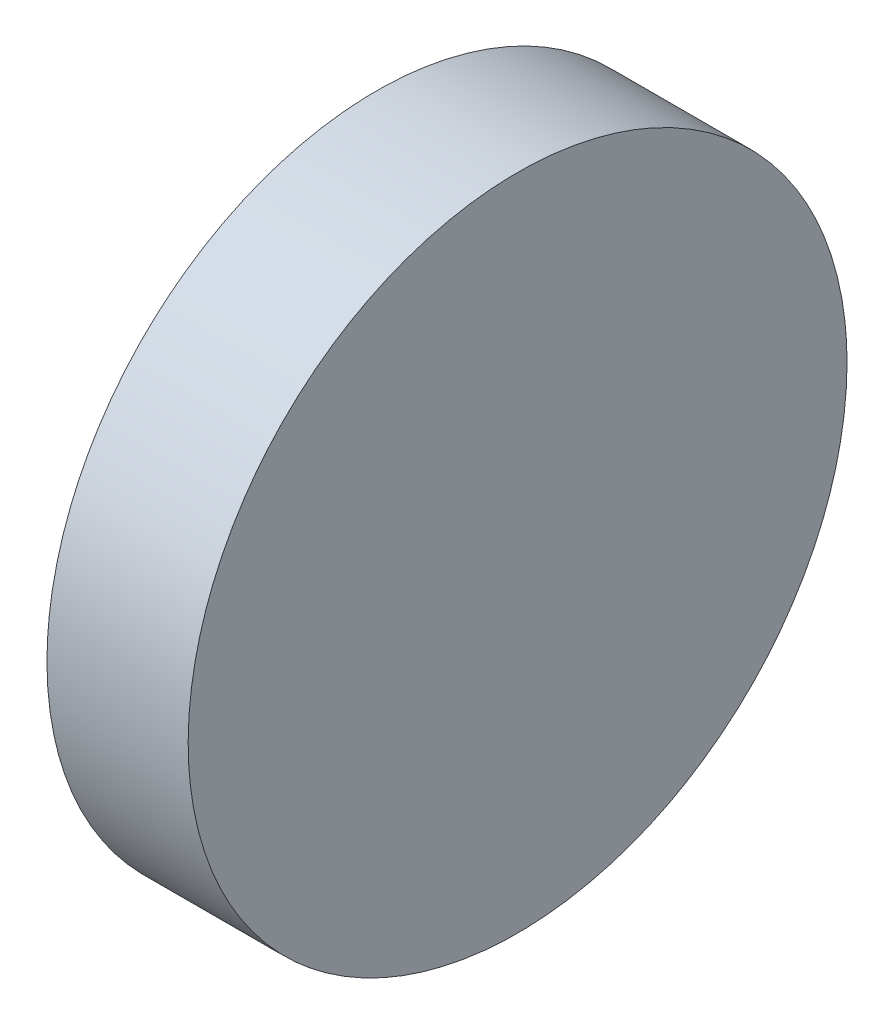
ISO-10303-21;
HEADER;
FILE_DESCRIPTION(('STEP AP214'),'2;1');
FILE_NAME('part.step','',(''),(''),'','','');
FILE_SCHEMA(('AUTOMOTIVE_DESIGN { 1 0 10303 214 1 1 1 1 }'));
ENDSEC;
DATA;
#1=APPLICATION_CONTEXT('core data for automotive mechanical design processes');
#2=APPLICATION_PROTOCOL_DEFINITION('international standard','automotive_design',2000,#1);
#3=PRODUCT_CONTEXT('',#1,'mechanical');
#4=PRODUCT('Part','Part','',(#3));
#5=PRODUCT_RELATED_PRODUCT_CATEGORY('part','',(#4));
#6=PRODUCT_DEFINITION_FORMATION('','',#4);
#7=PRODUCT_DEFINITION_CONTEXT('part definition',#1,'design');
#8=PRODUCT_DEFINITION('design','',#6,#7);
#9=PRODUCT_DEFINITION_SHAPE('','',#8);
#10=(LENGTH_UNIT() NAMED_UNIT(*) SI_UNIT(.MILLI.,.METRE.));
#11=(NAMED_UNIT(*) PLANE_ANGLE_UNIT() SI_UNIT($,.RADIAN.));
#12=(NAMED_UNIT(*) SI_UNIT($,.STERADIAN.) SOLID_ANGLE_UNIT());
#13=UNCERTAINTY_MEASURE_WITH_UNIT(LENGTH_MEASURE(1.E-05),#10,'distance_accuracy_value','');
#14=(GEOMETRIC_REPRESENTATION_CONTEXT(3) GLOBAL_UNCERTAINTY_ASSIGNED_CONTEXT((#13)) GLOBAL_UNIT_ASSIGNED_CONTEXT((#10,
#11,#12)) REPRESENTATION_CONTEXT('',''));
#15=CARTESIAN_POINT('',(0.,0.,0.));
#16=DIRECTION('',(0.,0.,1.));
#17=DIRECTION('',(1.,0.,0.));
#18=AXIS2_PLACEMENT_3D('',#15,#16,#17);
#19=CARTESIAN_POINT('',(24.3378726721836,72.9827002839282,19.0680504904314));
#20=CARTESIAN_POINT('',(24.3378726721836,73.1845762589774,19.0680504904314));
#21=CARTESIAN_POINT('',(24.3378726721836,73.5883282090757,19.1483617466597));
#22=CARTESIAN_POINT('',(24.3378726721836,74.1017547726504,19.4914224085805));
#23=CARTESIAN_POINT('',(24.3378726721836,74.4448154345712,20.0048489721551));
#24=CARTESIAN_POINT('',(24.3378726721836,74.5652823189135,20.6104768973026));
#25=CARTESIAN_POINT('',(24.3378726721836,74.4448154345712,21.2161048224502));
#26=CARTESIAN_POINT('',(24.3378726721836,74.1017547726503,21.7295313860247));
#27=CARTESIAN_POINT('',(24.3378726721836,73.5883282090757,22.0725920479456));
#28=CARTESIAN_POINT('',(24.3378726721836,72.9827002839282,22.1930589322879));
#29=CARTESIAN_POINT('',(24.3378726721836,72.3770723587807,22.0725920479456));
#30=CARTESIAN_POINT('',(24.3378726721836,71.8636457952061,21.7295313860248));
#31=CARTESIAN_POINT('',(24.3378726721836,71.5205851332853,21.2161048224502));
#32=CARTESIAN_POINT('',(24.3378726721836,71.4001182489429,20.6104768973026));
#33=CARTESIAN_POINT('',(24.3378726721836,71.5205851332853,20.0048489721551));
#34=CARTESIAN_POINT('',(24.3378726721836,71.8636457952061,19.4914224085805));
#35=CARTESIAN_POINT('',(24.3378726721836,72.3770723587808,19.1483617466597));
#36=CARTESIAN_POINT('',(24.3378726721836,72.7808243088791,19.0680504904314));
#37=CARTESIAN_POINT('',(24.3378726721836,72.9827002839282,19.0680504904314));
#38=B_SPLINE_CURVE_WITH_KNOTS('',3,(#19,#20,#21,#22,#23,#24,#25,#26,#27,#28,#29,#30,#31,#32,#33,
#34,#35,#36,#37),.UNSPECIFIED.,.T.,.F.,(4,1,1,1,1,1,1,1,1,1,1,1,1,1,1,1,4),(0.,0.0625,0.125,
0.1875,0.25,0.3125,0.375,0.4375,0.5,0.5625,0.625,0.6875,0.75,0.8125,0.875,0.9375,1.),.UNSPECIFIED.);
#39=DIRECTION('',(1.,0.,0.));
#40=VECTOR('',#39,1.);
#41=SURFACE_OF_LINEAR_EXTRUSION('',#38,#40);
#42=CARTESIAN_POINT('',(24.3378726721836,72.9827002839282,19.0680504904314));
#43=CARTESIAN_POINT('',(24.3378726721836,73.0064508886733,19.068050473735));
#44=CARTESIAN_POINT('',(24.3378726721836,73.0302010762025,19.0686062989326));
#45=CARTESIAN_POINT('',(24.3378726721836,73.077651410537,19.0708195103253));
#46=CARTESIAN_POINT('',(24.3378726721836,73.1013515545836,19.0724769557398));
#47=CARTESIAN_POINT('',(24.3378726721836,73.1486515866271,19.0768834275041));
#48=CARTESIAN_POINT('',(24.3378726721836,73.1722514679272,19.0796325256457));
#49=CARTESIAN_POINT('',(24.3378726721836,73.2193010510757,19.0862123470967));
#50=CARTESIAN_POINT('',(24.3378726721836,73.2427507458694,19.0900431208397));
#51=CARTESIAN_POINT('',(24.3378726721836,73.2894499432848,19.0987763891936));
#52=CARTESIAN_POINT('',(24.3378726721836,73.3126994438637,19.1036788947262));
#53=CARTESIAN_POINT('',(24.3378726721836,73.35894827338,19.1145456935742));
#54=CARTESIAN_POINT('',(24.3378726721836,73.3819476097291,19.1205099553413));
#55=CARTESIAN_POINT('',(24.3378726721836,73.4276460489969,19.1334905049019));
#56=CARTESIAN_POINT('',(24.3378726721836,73.4503451696174,19.1405067303642));
#57=CARTESIAN_POINT('',(24.3378726721836,73.495393382694,19.1555808064373));
#58=CARTESIAN_POINT('',(24.3378726721836,73.5177424976411,19.1636385898081));
#59=CARTESIAN_POINT('',(24.3378726721836,73.5620399154895,19.1807876959835));
#60=CARTESIAN_POINT('',(24.3378726721836,73.583988231089,19.1898789859783));
#61=CARTESIAN_POINT('',(24.3378726721836,73.6274374848947,19.2090757412506));
#62=CARTESIAN_POINT('',(24.3378726721836,73.6489384088799,19.2191812387071));
#63=CARTESIAN_POINT('',(24.3378726721836,73.6914512872705,19.2403761542786));
#64=CARTESIAN_POINT('',(24.3378726721836,73.7124632100336,19.2514656358429));
#65=CARTESIAN_POINT('',(24.3378726721836,73.7539555208297,19.2746006773862));
#66=CARTESIAN_POINT('',(24.3378726721836,73.774435877305,19.2866462939569));
#67=CARTESIAN_POINT('',(24.3378726721836,73.8148227258712,19.3116651682779));
#68=CARTESIAN_POINT('',(24.3378726721836,73.834729200895,19.324638453577));
#69=CARTESIAN_POINT('',(24.3378726721836,73.8739258717036,19.3514844175922));
#70=CARTESIAN_POINT('',(24.3378726721836,73.8932160737668,19.3653570871411));
#71=CARTESIAN_POINT('',(24.3378726721836,73.9311377955308,19.3939735370798));
#72=CARTESIAN_POINT('',(24.3378726721836,73.9497693459045,19.4087172768186));
#73=CARTESIAN_POINT('',(24.3378726721836,73.9863313426124,19.4390475780041));
#74=CARTESIAN_POINT('',(24.3378726721836,74.0042618349781,19.4546340839539));
#75=CARTESIAN_POINT('',(24.3378726721836,74.0393793498961,19.4866216579583));
#76=CARTESIAN_POINT('',(24.3378726721836,74.0565664123639,19.5030226821787));
#77=CARTESIAN_POINT('',(24.3378726721836,74.0901544990522,19.536610768867));
#78=CARTESIAN_POINT('',(24.3378726721836,74.1065555232726,19.5537978313348));
#79=CARTESIAN_POINT('',(24.3378726721836,74.1385430972771,19.5889153462528));
#80=CARTESIAN_POINT('',(24.3378726721836,74.1541296032268,19.6068458386185));
#81=CARTESIAN_POINT('',(24.3378726721836,74.1844599044123,19.6434078353264));
#82=CARTESIAN_POINT('',(24.3378726721836,74.1992036441511,19.6620393857001));
#83=CARTESIAN_POINT('',(24.3378726721836,74.2278200940898,19.6999611074641));
#84=CARTESIAN_POINT('',(24.3378726721836,74.2416927636387,19.7192513095273));
#85=CARTESIAN_POINT('',(24.3378726721836,74.2685387276539,19.7584479803359));
#86=CARTESIAN_POINT('',(24.3378726721836,74.281512012953,19.7783544553597));
#87=CARTESIAN_POINT('',(24.3378726721836,74.306530887274,19.8187413039259));
#88=CARTESIAN_POINT('',(24.3378726721836,74.3185765038447,19.8392216604011));
#89=CARTESIAN_POINT('',(24.3378726721836,74.341711545388,19.8807139711974));
#90=CARTESIAN_POINT('',(24.3378726721836,74.3528010269523,19.9017258939608));
#91=CARTESIAN_POINT('',(24.3378726721836,74.3739959425238,19.9442387723505));
#92=CARTESIAN_POINT('',(24.3378726721836,74.3841014399804,19.9657396963345));
#93=CARTESIAN_POINT('',(24.3378726721836,74.4032981952524,20.0091889501436));
#94=CARTESIAN_POINT('',(24.3378726721836,74.4123894852469,20.0311372657477));
#95=CARTESIAN_POINT('',(24.3378726721836,74.4295385914232,20.0754346835833));
#96=CARTESIAN_POINT('',(24.3378726721836,74.4375963747952,20.097783798513));
#97=CARTESIAN_POINT('',(24.3378726721836,74.452670450865,20.1428320116374));
#98=CARTESIAN_POINT('',(24.3378726721836,74.4596866763228,20.1655311323231));
#99=CARTESIAN_POINT('',(24.3378726721836,74.4726672258958,20.2112295714126));
#100=CARTESIAN_POINT('',(24.3378726721836,74.4786314876798,20.2342289075181));
#101=CARTESIAN_POINT('',(24.3378726721836,74.4894982864816,20.2804777377));
#102=CARTESIAN_POINT('',(24.3378726721836,74.4944007919513,20.3037272391881));
#103=CARTESIAN_POINT('',(24.3378726721836,74.5031340604773,20.3504264341194));
#104=CARTESIAN_POINT('',(24.3378726721836,74.5069648344554,20.37387612552));
#105=CARTESIAN_POINT('',(24.3378726721836,74.5135446552639,20.4209257179387));
#106=CARTESIAN_POINT('',(24.3378726721836,74.5162937525278,20.4445256119014));
#107=CARTESIAN_POINT('',(24.3378726721836,74.5207002266899,20.4918256093509));
#108=CARTESIAN_POINT('',(24.3378726721836,74.5223576753797,20.5155257061448));
#109=CARTESIAN_POINT('',(24.3378726721836,74.5245708778244,20.562976169574));
#110=CARTESIAN_POINT('',(24.3378726721836,74.5251266907994,20.5867265334383));
#111=CARTESIAN_POINT('',(24.3378726721836,74.5251266907994,20.634227261167));
#112=CARTESIAN_POINT('',(24.3378726721836,74.5245708778244,20.6579776250313));
#113=CARTESIAN_POINT('',(24.3378726721836,74.5223576753797,20.7054280884605));
#114=CARTESIAN_POINT('',(24.3378726721836,74.5207002266899,20.7291281852544));
#115=CARTESIAN_POINT('',(24.3378726721836,74.5162937525278,20.7764281827039));
#116=CARTESIAN_POINT('',(24.3378726721836,74.5135446552639,20.8000280766666));
#117=CARTESIAN_POINT('',(24.3378726721836,74.5069648344554,20.8470776690853));
#118=CARTESIAN_POINT('',(24.3378726721836,74.5031340604773,20.8705273604858));
#119=CARTESIAN_POINT('',(24.3378726721836,74.4944007919512,20.9172265554172));
#120=CARTESIAN_POINT('',(24.3378726721836,74.4894982864816,20.9404760569053));
#121=CARTESIAN_POINT('',(24.3378726721836,74.4786314876797,20.9867248870872));
#122=CARTESIAN_POINT('',(24.3378726721836,74.4726672258958,21.0097242231927));
#123=CARTESIAN_POINT('',(24.3378726721836,74.4596866763228,21.0554226622822));
#124=CARTESIAN_POINT('',(24.3378726721836,74.452670450865,21.0781217829679));
#125=CARTESIAN_POINT('',(24.3378726721836,74.4375963747952,21.1231699960923));
#126=CARTESIAN_POINT('',(24.3378726721836,74.4295385914232,21.145519111022));
#127=CARTESIAN_POINT('',(24.3378726721836,74.4123894852469,21.1898165288576));
#128=CARTESIAN_POINT('',(24.3378726721836,74.4032981952524,21.2117648444617));
#129=CARTESIAN_POINT('',(24.3378726721836,74.3841014399804,21.2552140982709));
#130=CARTESIAN_POINT('',(24.3378726721836,74.3739959425238,21.2767150222548));
#131=CARTESIAN_POINT('',(24.3378726721836,74.3528010269523,21.3192279006445));
#132=CARTESIAN_POINT('',(24.3378726721836,74.341711545388,21.3402398234079));
#133=CARTESIAN_POINT('',(24.3378726721836,74.3185765038447,21.3817321342042));
#134=CARTESIAN_POINT('',(24.3378726721836,74.306530887274,21.4022124906794));
#135=CARTESIAN_POINT('',(24.3378726721836,74.281512012953,21.4425993392456));
#136=CARTESIAN_POINT('',(24.3378726721836,74.2685387276539,21.4625058142694));
#137=CARTESIAN_POINT('',(24.3378726721836,74.2416927636387,21.501702485078));
#138=CARTESIAN_POINT('',(24.3378726721836,74.2278200940898,21.5209926871412));
#139=CARTESIAN_POINT('',(24.3378726721836,74.1992036441511,21.5589144089052));
#140=CARTESIAN_POINT('',(24.3378726721836,74.1844599044122,21.5775459592789));
#141=CARTESIAN_POINT('',(24.3378726721836,74.1541296032268,21.6141079559868));
#142=CARTESIAN_POINT('',(24.3378726721836,74.138543097277,21.6320384483525));
#143=CARTESIAN_POINT('',(24.3378726721836,74.1065555232726,21.6671559632705));
#144=CARTESIAN_POINT('',(24.3378726721836,74.0901544990522,21.6843430257383));
#145=CARTESIAN_POINT('',(24.3378726721836,74.0565664123639,21.7179311124266));
#146=CARTESIAN_POINT('',(24.3378726721836,74.0393793498961,21.734332136647));
#147=CARTESIAN_POINT('',(24.3378726721836,74.0042618349781,21.7663197106514));
#148=CARTESIAN_POINT('',(24.3378726721836,73.9863313426124,21.7819062166012));
#149=CARTESIAN_POINT('',(24.3378726721836,73.9497693459045,21.8122365177867));
#150=CARTESIAN_POINT('',(24.3378726721836,73.9311377955307,21.8269802575255));
#151=CARTESIAN_POINT('',(24.3378726721836,73.8932160737668,21.8555967074642));
#152=CARTESIAN_POINT('',(24.3378726721836,73.8739258717036,21.8694693770131));
#153=CARTESIAN_POINT('',(24.3378726721836,73.834729200895,21.8963153410283));
#154=CARTESIAN_POINT('',(24.3378726721836,73.8148227258712,21.9092886263274));
#155=CARTESIAN_POINT('',(24.3378726721836,73.774435877305,21.9343075006484));
#156=CARTESIAN_POINT('',(24.3378726721836,73.7539555208298,21.9463531172191));
#157=CARTESIAN_POINT('',(24.3378726721836,73.7124632100334,21.9694881587624));
#158=CARTESIAN_POINT('',(24.3378726721836,73.69145128727,21.9805776403267));
#159=CARTESIAN_POINT('',(24.3378726721836,73.6489384088804,22.0017725558982));
#160=CARTESIAN_POINT('',(24.3378726721836,73.6274374848964,22.0118780533548));
#161=CARTESIAN_POINT('',(24.3378726721836,73.5839882310872,22.0310748086268));
#162=CARTESIAN_POINT('',(24.3378726721836,73.5620399154831,22.0401660986213));
#163=CARTESIAN_POINT('',(24.3378726721836,73.5177424976475,22.0573152047976));
#164=CARTESIAN_POINT('',(24.3378726721836,73.4953933827179,22.0653729881697));
#165=CARTESIAN_POINT('',(24.3378726721836,73.4503451695935,22.0804470642394));
#166=CARTESIAN_POINT('',(24.3378726721836,73.4276460489077,22.0874632896972));
#167=CARTESIAN_POINT('',(24.3378726721836,73.3819476098183,22.1004438392702));
#168=CARTESIAN_POINT('',(24.3378726721836,73.3589482737128,22.1064081010542));
#169=CARTESIAN_POINT('',(24.3378726721836,73.3126994435309,22.117274899856));
#170=CARTESIAN_POINT('',(24.3378726721836,73.2894499420427,22.1221774053256));
#171=CARTESIAN_POINT('',(24.3378726721836,73.2427507471114,22.1309106738517));
#172=CARTESIAN_POINT('',(24.3378726721836,73.2193010557109,22.1347414478298));
#173=CARTESIAN_POINT('',(24.3378726721836,73.1722514632922,22.1413212686383));
#174=CARTESIAN_POINT('',(24.3378726721836,73.1486515693295,22.1440703659022));
#175=CARTESIAN_POINT('',(24.3378726721836,73.10135157188,22.1484768400644));
#176=CARTESIAN_POINT('',(24.3378726721836,73.0776514750861,22.1501342887541));
#177=CARTESIAN_POINT('',(24.3378726721836,73.0302010116569,22.1523474911988));
#178=CARTESIAN_POINT('',(24.3378726721836,73.0064506477926,22.1529033041738));
#179=CARTESIAN_POINT('',(24.3378726721836,72.9589499200639,22.1529033041738));
#180=CARTESIAN_POINT('',(24.3378726721836,72.9351995561995,22.1523474911988));
#181=CARTESIAN_POINT('',(24.3378726721836,72.8877490927704,22.1501342887541));
#182=CARTESIAN_POINT('',(24.3378726721836,72.8640489959765,22.1484768400644));
#183=CARTESIAN_POINT('',(24.3378726721836,72.8167489985269,22.1440703659022));
#184=CARTESIAN_POINT('',(24.3378726721836,72.7931491045643,22.1413212686383));
#185=CARTESIAN_POINT('',(24.3378726721836,72.7460995121456,22.1347414478298));
#186=CARTESIAN_POINT('',(24.3378726721836,72.722649820745,22.1309106738517));
#187=CARTESIAN_POINT('',(24.3378726721836,72.6759506258137,22.1221774053256));
#188=CARTESIAN_POINT('',(24.3378726721836,72.6527011243256,22.117274899856));
#189=CARTESIAN_POINT('',(24.3378726721836,72.6064522941436,22.1064081010542));
#190=CARTESIAN_POINT('',(24.3378726721836,72.5834529580382,22.1004438392702));
#191=CARTESIAN_POINT('',(24.3378726721836,72.5377545189487,22.0874632896972));
#192=CARTESIAN_POINT('',(24.3378726721836,72.5150553982629,22.0804470642394));
#193=CARTESIAN_POINT('',(24.3378726721836,72.4700071851386,22.0653729881696));
#194=CARTESIAN_POINT('',(24.3378726721836,72.4476580702089,22.0573152047976));
#195=CARTESIAN_POINT('',(24.3378726721836,72.4033606523733,22.0401660986213));
#196=CARTESIAN_POINT('',(24.3378726721836,72.3814123367692,22.0310748086268));
#197=CARTESIAN_POINT('',(24.3378726721836,72.33796308296,22.0118780533548));
#198=CARTESIAN_POINT('',(24.3378726721836,72.3164621589761,22.0017725558982));
#199=CARTESIAN_POINT('',(24.3378726721836,72.2739492805864,21.9805776403267));
#200=CARTESIAN_POINT('',(24.3378726721836,72.252937357823,21.9694881587624));
#201=CARTESIAN_POINT('',(24.3378726721836,72.2114450470266,21.9463531172191));
#202=CARTESIAN_POINT('',(24.3378726721836,72.1909646905514,21.9343075006484));
#203=CARTESIAN_POINT('',(24.3378726721836,72.1505778419853,21.9092886263274));
#204=CARTESIAN_POINT('',(24.3378726721836,72.1306713669614,21.8963153410283));
#205=CARTESIAN_POINT('',(24.3378726721836,72.0914746961529,21.8694693770131));
#206=CARTESIAN_POINT('',(24.3378726721836,72.0721844940897,21.8555967074642));
#207=CARTESIAN_POINT('',(24.3378726721836,72.0342627723257,21.8269802575255));
#208=CARTESIAN_POINT('',(24.3378726721836,72.015631221952,21.8122365177866));
#209=CARTESIAN_POINT('',(24.3378726721836,71.9790692252441,21.7819062166012));
#210=CARTESIAN_POINT('',(24.3378726721836,71.9611387328783,21.7663197106514));
#211=CARTESIAN_POINT('',(24.3378726721836,71.9260212179604,21.734332136647));
#212=CARTESIAN_POINT('',(24.3378726721836,71.9088341554925,21.7179311124266));
#213=CARTESIAN_POINT('',(24.3378726721836,71.8752460688043,21.6843430257383));
#214=CARTESIAN_POINT('',(24.3378726721836,71.8588450445839,21.6671559632705));
#215=CARTESIAN_POINT('',(24.3378726721836,71.8268574705794,21.6320384483525));
#216=CARTESIAN_POINT('',(24.3378726721836,71.8112709646297,21.6141079559868));
#217=CARTESIAN_POINT('',(24.3378726721836,71.7809406634442,21.5775459592789));
#218=CARTESIAN_POINT('',(24.3378726721836,71.7661969237054,21.5589144089051));
#219=CARTESIAN_POINT('',(24.3378726721836,71.7375804737667,21.5209926871412));
#220=CARTESIAN_POINT('',(24.3378726721836,71.7237078042178,21.501702485078));
#221=CARTESIAN_POINT('',(24.3378726721836,71.6968618402026,21.4625058142694));
#222=CARTESIAN_POINT('',(24.3378726721836,71.6838885549035,21.4425993392456));
#223=CARTESIAN_POINT('',(24.3378726721836,71.6588696805825,21.4022124906794));
#224=CARTESIAN_POINT('',(24.3378726721836,71.6468240640118,21.3817321342042));
#225=CARTESIAN_POINT('',(24.3378726721836,71.6236890224685,21.3402398234079));
#226=CARTESIAN_POINT('',(24.3378726721836,71.6125995409042,21.3192279006444));
#227=CARTESIAN_POINT('',(24.3378726721836,71.5914046253327,21.2767150222548));
#228=CARTESIAN_POINT('',(24.3378726721836,71.5812991278761,21.2552140982708));
#229=CARTESIAN_POINT('',(24.3378726721836,71.5621023726041,21.2117648444617));
#230=CARTESIAN_POINT('',(24.3378726721836,71.5530110826096,21.1898165288575));
#231=CARTESIAN_POINT('',(24.3378726721836,71.5358619764332,21.1455191110219));
#232=CARTESIAN_POINT('',(24.3378726721836,71.5278041930612,21.1231699960923));
#233=CARTESIAN_POINT('',(24.3378726721836,71.5127301169914,21.0781217829679));
#234=CARTESIAN_POINT('',(24.3378726721836,71.5057138915336,21.0554226622822));
#235=CARTESIAN_POINT('',(24.3378726721836,71.4927333419607,21.0097242231927));
#236=CARTESIAN_POINT('',(24.3378726721836,71.4867690801767,20.9867248870872));
#237=CARTESIAN_POINT('',(24.3378726721836,71.4759022813749,20.9404760569053));
#238=CARTESIAN_POINT('',(24.3378726721836,71.4709997759053,20.9172265554171));
#239=CARTESIAN_POINT('',(24.3378726721836,71.4622665073792,20.8705273604858));
#240=CARTESIAN_POINT('',(24.3378726721836,71.458435733401,20.8470776690853));
#241=CARTESIAN_POINT('',(24.3378726721836,71.4518559125926,20.8000280766666));
#242=CARTESIAN_POINT('',(24.3378726721836,71.4491068153287,20.7764281827039));
#243=CARTESIAN_POINT('',(24.3378726721836,71.4447003411665,20.7291281852544));
#244=CARTESIAN_POINT('',(24.3378726721836,71.4430428924767,20.7054280884605));
#245=CARTESIAN_POINT('',(24.3378726721836,71.4408296900321,20.6579776250313));
#246=CARTESIAN_POINT('',(24.3378726721836,71.440273877057,20.634227261167));
#247=CARTESIAN_POINT('',(24.3378726721836,71.440273877057,20.5867265334383));
#248=CARTESIAN_POINT('',(24.3378726721836,71.4408296900321,20.5629761695739));
#249=CARTESIAN_POINT('',(24.3378726721836,71.4430428924767,20.5155257061448));
#250=CARTESIAN_POINT('',(24.3378726721836,71.4447003411665,20.4918256093509));
#251=CARTESIAN_POINT('',(24.3378726721836,71.4491068153287,20.4445256119013));
#252=CARTESIAN_POINT('',(24.3378726721836,71.4518559125926,20.4209257179386));
#253=CARTESIAN_POINT('',(24.3378726721836,71.458435733401,20.37387612552));
#254=CARTESIAN_POINT('',(24.3378726721836,71.4622665073792,20.3504264341194));
#255=CARTESIAN_POINT('',(24.3378726721836,71.4709997759053,20.3037272391881));
#256=CARTESIAN_POINT('',(24.3378726721836,71.4759022813748,20.2804777377));
#257=CARTESIAN_POINT('',(24.3378726721836,71.4867690801767,20.2342289075181));
#258=CARTESIAN_POINT('',(24.3378726721836,71.4927333419607,20.2112295714126));
#259=CARTESIAN_POINT('',(24.3378726721836,71.5057138915336,20.1655311323231));
#260=CARTESIAN_POINT('',(24.3378726721836,71.5127301169914,20.1428320116374));
#261=CARTESIAN_POINT('',(24.3378726721836,71.5278041930612,20.097783798513));
#262=CARTESIAN_POINT('',(24.3378726721836,71.5358619764332,20.0754346835833));
#263=CARTESIAN_POINT('',(24.3378726721836,71.5530110826096,20.0311372657477));
#264=CARTESIAN_POINT('',(24.3378726721836,71.562102372604,20.0091889501436));
#265=CARTESIAN_POINT('',(24.3378726721836,71.5812991278761,19.9657396963344));
#266=CARTESIAN_POINT('',(24.3378726721836,71.5914046253327,19.9442387723505));
#267=CARTESIAN_POINT('',(24.3378726721836,71.6125995409042,19.9017258939608));
#268=CARTESIAN_POINT('',(24.3378726721836,71.6236890224685,19.8807139711974));
#269=CARTESIAN_POINT('',(24.3378726721836,71.6468240640118,19.8392216604011));
#270=CARTESIAN_POINT('',(24.3378726721836,71.6588696805825,19.8187413039259));
#271=CARTESIAN_POINT('',(24.3378726721836,71.6838885549035,19.7783544553597));
#272=CARTESIAN_POINT('',(24.3378726721836,71.6968618402026,19.7584479803358));
#273=CARTESIAN_POINT('',(24.3378726721836,71.7237078042178,19.7192513095273));
#274=CARTESIAN_POINT('',(24.3378726721836,71.7375804737667,19.6999611074641));
#275=CARTESIAN_POINT('',(24.3378726721836,71.7661969237054,19.6620393857001));
#276=CARTESIAN_POINT('',(24.3378726721836,71.7809406634442,19.6434078353264));
#277=CARTESIAN_POINT('',(24.3378726721836,71.8112709646297,19.6068458386185));
#278=CARTESIAN_POINT('',(24.3378726721836,71.8268574705794,19.5889153462527));
#279=CARTESIAN_POINT('',(24.3378726721836,71.8588450445839,19.5537978313348));
#280=CARTESIAN_POINT('',(24.3378726721836,71.8752460688043,19.5366107688669));
#281=CARTESIAN_POINT('',(24.3378726721836,71.9088341554926,19.5030226821787));
#282=CARTESIAN_POINT('',(24.3378726721836,71.9260212179604,19.4866216579583));
#283=CARTESIAN_POINT('',(24.3378726721836,71.9611387328784,19.4546340839539));
#284=CARTESIAN_POINT('',(24.3378726721836,71.9790692252441,19.4390475780041));
#285=CARTESIAN_POINT('',(24.3378726721836,72.015631221952,19.4087172768186));
#286=CARTESIAN_POINT('',(24.3378726721836,72.0342627723257,19.3939735370798));
#287=CARTESIAN_POINT('',(24.3378726721836,72.0721844940897,19.3653570871411));
#288=CARTESIAN_POINT('',(24.3378726721836,72.0914746961529,19.3514844175922));
#289=CARTESIAN_POINT('',(24.3378726721836,72.1306713669615,19.324638453577));
#290=CARTESIAN_POINT('',(24.3378726721836,72.1505778419853,19.3116651682779));
#291=CARTESIAN_POINT('',(24.3378726721836,72.1909646905515,19.2866462939569));
#292=CARTESIAN_POINT('',(24.3378726721836,72.2114450470268,19.2746006773862));
#293=CARTESIAN_POINT('',(24.3378726721836,72.2529373578229,19.2514656358429));
#294=CARTESIAN_POINT('',(24.3378726721836,72.273949280586,19.2403761542786));
#295=CARTESIAN_POINT('',(24.3378726721836,72.3164621589765,19.2191812387071));
#296=CARTESIAN_POINT('',(24.3378726721836,72.3379630829618,19.2090757412506));
#297=CARTESIAN_POINT('',(24.3378726721836,72.3814123367675,19.1898789859783));
#298=CARTESIAN_POINT('',(24.3378726721836,72.403360652367,19.1807876959835));
#299=CARTESIAN_POINT('',(24.3378726721836,72.4476580702153,19.1636385898081));
#300=CARTESIAN_POINT('',(24.3378726721836,72.4700071851625,19.1555808064373));
#301=CARTESIAN_POINT('',(24.3378726721836,72.5150553982391,19.1405067303642));
#302=CARTESIAN_POINT('',(24.3378726721836,72.5377545188596,19.1334905049019));
#303=CARTESIAN_POINT('',(24.3378726721836,72.5834529581274,19.1205099553413));
#304=CARTESIAN_POINT('',(24.3378726721836,72.6064522944764,19.1145456935742));
#305=CARTESIAN_POINT('',(24.3378726721836,72.6527011239928,19.1036788947262));
#306=CARTESIAN_POINT('',(24.3378726721836,72.6759506245717,19.0987763891936));
#307=CARTESIAN_POINT('',(24.3378726721836,72.7226498219871,19.0900431208397));
#308=CARTESIAN_POINT('',(24.3378726721836,72.7460995167808,19.0862123470967));
#309=CARTESIAN_POINT('',(24.3378726721836,72.7931490999293,19.0796325256457));
#310=CARTESIAN_POINT('',(24.3378726721836,72.8167489812294,19.0768834275041));
#311=CARTESIAN_POINT('',(24.3378726721836,72.8640490132729,19.0724769557398));
#312=CARTESIAN_POINT('',(24.3378726721836,72.8877491573194,19.0708195103253));
#313=CARTESIAN_POINT('',(24.3378726721836,72.935199491654,19.0686062989326));
#314=CARTESIAN_POINT('',(24.3378726721836,72.9589496791832,19.068050473735));
#315=CARTESIAN_POINT('',(24.3378726721836,72.9827002839282,19.0680504904314));
#316=B_SPLINE_CURVE_WITH_KNOTS('',3,(#42,#43,#44,#45,#46,#47,#48,#49,#50,#51,#52,#53,#54,#55,
#56,#57,#58,#59,#60,#61,#62,#63,#64,#65,#66,#67,#68,#69,#70,#71,#72,#73,#74,#75,#76,#77,#78,#79,
#80,#81,#82,#83,#84,#85,#86,#87,#88,#89,#90,#91,#92,#93,#94,#95,#96,#97,#98,#99,#100,#101,#102,
#103,#104,#105,#106,#107,#108,#109,#110,#111,#112,#113,#114,#115,#116,#117,#118,#119,#120,#121,
#122,#123,#124,#125,#126,#127,#128,#129,#130,#131,#132,#133,#134,#135,#136,#137,#138,#139,#140,
#141,#142,#143,#144,#145,#146,#147,#148,#149,#150,#151,#152,#153,#154,#155,#156,#157,#158,#159,
#160,#161,#162,#163,#164,#165,#166,#167,#168,#169,#170,#171,#172,#173,#174,#175,#176,#177,#178,
#179,#180,#181,#182,#183,#184,#185,#186,#187,#188,#189,#190,#191,#192,#193,#194,#195,#196,#197,
#198,#199,#200,#201,#202,#203,#204,#205,#206,#207,#208,#209,#210,#211,#212,#213,#214,#215,#216,
#217,#218,#219,#220,#221,#222,#223,#224,#225,#226,#227,#228,#229,#230,#231,#232,#233,#234,#235,
#236,#237,#238,#239,#240,#241,#242,#243,#244,#245,#246,#247,#248,#249,#250,#251,#252,#253,#254,
#255,#256,#257,#258,#259,#260,#261,#262,#263,#264,#265,#266,#267,#268,#269,#270,#271,#272,#273,
#274,#275,#276,#277,#278,#279,#280,#281,#282,#283,#284,#285,#286,#287,#288,#289,#290,#291,#292,
#293,#294,#295,#296,#297,#298,#299,#300,#301,#302,#303,#304,#305,#306,#307,#308,#309,#310,#311,
#312,#313,#314,#315),.UNSPECIFIED.,.F.,.F.,(4,2,2,2,2,2,2,2,2,2,2,2,2,2,2,2,2,2,2,2,2,2,2,2,2,2,
2,2,2,2,2,2,2,2,2,2,2,2,2,2,2,2,2,2,2,2,2,2,2,2,2,2,2,2,2,2,2,2,2,2,2,2,2,2,2,2,2,2,2,2,2,2,2,2,
2,2,2,2,2,2,2,2,2,2,2,2,2,2,2,2,2,2,2,2,2,2,2,2,2,2,2,2,2,2,2,2,2,2,2,2,2,2,2,2,2,2,2,2,2,2,2,2,
2,2,2,2,2,2,2,2,2,2,2,2,2,2,4),(0.,0.0712447189305388,0.142493268043481,0.213746503539572,
0.285003061796028,0.356260346243393,0.427515513755083,0.498766460909602,0.570012810604857,
0.641256899134909,0.712503248830173,0.783754195984708,0.855009363496394,0.926266647943743,
0.997523206200201,1.06877644169629,1.14002499080922,1.21126970973978,1.28251442867033,
1.35376297778327,1.42501621327934,1.4962727715358,1.56753005598315,1.63878522349483,
1.71003617064935,1.78128252034462,1.85252660887466,1.92377295856992,1.99502390572443,
2.06627907323613,2.13753635768349,2.20879291593994,2.28004615143602,2.35129470054895,
2.4225394194795,2.49378413841005,2.56503268752299,2.63628592301907,2.70754248127553,
2.77879976572289,2.85005493323458,2.9213058803891,2.99255223008436,3.06379631861439,
3.13504266830966,3.20629361546418,3.27754878297587,3.34880606742323,3.42006262567968,
3.49131586117577,3.56256441028871,3.63380912921924,3.7050538481498,3.77630239726273,
3.84755563275882,3.91881219101526,3.99006947546262,4.06132464297431,4.13257559012885,
4.2038219398241,4.27506602835414,4.34631237804942,4.41756332520391,4.4888184927156,
4.56007577716298,4.63133233541942,4.70258557091551,4.77383412002843,4.84507883895899,
4.91632355788956,4.98757210700247,5.05882534249856,5.13008190075502,5.20133918520238,
5.27259435271407,5.34384529986859,5.41509164956386,5.4863357380939,5.55758208778917,
5.62883303494368,5.70008820245536,5.77134548690272,5.84260204515917,5.91385528065526,
5.98510382976819,6.05634854869873,6.12759326762928,6.19884181674221,6.27009505223829,
6.34135161049473,6.4126088949421,6.48386406245378,6.55511500960831,6.62636135930357,
6.69760544783361,6.76885179752888,6.8401027446834,6.91135791219509,6.98261519664245,
7.0538717548989,7.12512499039499,7.19637353950792,7.26761825843846,7.33886297736901,
7.41011152648195,7.48136476197803,7.55262132023449,7.62387860468184,7.69513377219354,
7.76638471934805,7.83763106904331,7.90887515757335,7.98012150726862,8.05137245442314,
8.12262762193483,8.19388490638219,8.26514146463864,8.33639470013473,8.40764324924766,
8.47888796817821,8.55013268710876,8.62138123622169,8.69263447171778,8.76389102997423,
8.8351483144216,8.90640348193329,8.9776544290878,9.04890077878306,9.1201448673131,
9.19139121700837,9.26264216416287,9.33389733167456,9.40515461612194,9.47641117437838,
9.54766440987446,9.6189129589874,9.69015767791793),.UNSPECIFIED.);
#317=CARTESIAN_POINT('',(24.3378726721836,72.9827002839282,19.0680504904314));
#318=VERTEX_POINT('',#317);
#319=EDGE_CURVE('E10',#318,#318,#316,.T.);
#320=ORIENTED_EDGE('',*,*,#319,.T.);
#321=EDGE_LOOP('',(#320));
#322=FACE_BOUND('',#321,.T.);
#323=CARTESIAN_POINT('',(24.999,72.9827002839282,19.0680504904314));
#324=CARTESIAN_POINT('',(24.999,72.9625123958904,19.0680504783098));
#325=CARTESIAN_POINT('',(24.999,72.9423247335125,19.0684520572947));
#326=CARTESIAN_POINT('',(24.999,72.9019801405749,19.0700521813405));
#327=CARTESIAN_POINT('',(24.999,72.8818232113342,19.0712507596878));
#328=CARTESIAN_POINT('',(24.999,72.8415709172143,19.074438755532));
#329=CARTESIAN_POINT('',(24.999,72.8214755558858,19.0764282178038));
#330=CARTESIAN_POINT('',(24.999,72.7813770709176,19.0811918609077));
#331=CARTESIAN_POINT('',(24.999,72.7613739519203,19.0839660808058));
#332=CARTESIAN_POINT('',(24.999,72.7214906697496,19.0902931400814));
#333=CARTESIAN_POINT('',(24.999,72.7016105100975,19.0938460016522));
#334=CARTESIAN_POINT('',(24.999,72.6620038560104,19.1017242550858));
#335=CARTESIAN_POINT('',(24.999,72.6422773615755,19.1060496469485));
#336=CARTESIAN_POINT('',(24.999,72.6030087538252,19.1154668770592));
#337=CARTESIAN_POINT('',(24.999,72.58346663527,19.1205586934559));
#338=CARTESIAN_POINT('',(24.999,72.5445974940018,19.1315026893043));
#339=CARTESIAN_POINT('',(24.999,72.5252704606283,19.1373548308872));
#340=CARTESIAN_POINT('',(24.999,72.4868622133753,19.1498133840822));
#341=CARTESIAN_POINT('',(24.999,72.4677809856399,19.15641975297));
#342=CARTESIAN_POINT('',(24.999,72.4298950389956,19.1703806711392));
#343=CARTESIAN_POINT('',(24.999,72.4110903085714,19.1777351891609));
#344=CARTESIAN_POINT('',(24.999,72.3737881961811,19.1931862300179));
#345=CARTESIAN_POINT('',(24.999,72.3552908142149,19.2012827528532));
#346=CARTESIAN_POINT('',(24.999,72.3186295445209,19.2182003027294));
#347=CARTESIAN_POINT('',(24.999,72.3004656707546,19.227021360017));
#348=CARTESIAN_POINT('',(24.999,72.2644974112249,19.2453705646497));
#349=CARTESIAN_POINT('',(24.999,72.2466930458746,19.2548987520033));
#350=CARTESIAN_POINT('',(24.999,72.2114698388107,19.2746448117152));
#351=CARTESIAN_POINT('',(24.999,72.1940510163363,19.284862718389));
#352=CARTESIAN_POINT('',(24.999,72.1596249302989,19.3059708298712));
#353=CARTESIAN_POINT('',(24.999,72.142617678482,19.3168610538358));
#354=CARTESIAN_POINT('',(24.999,72.1090407781393,19.3392964213724));
#355=CARTESIAN_POINT('',(24.999,72.0924711296135,19.3508415649443));
#356=CARTESIAN_POINT('',(24.999,72.0597954846774,19.3745693966659));
#357=CARTESIAN_POINT('',(24.999,72.0436894750642,19.386752066633));
#358=CARTESIAN_POINT('',(24.999,72.0119671568705,19.4117375768025));
#359=CARTESIAN_POINT('',(24.999,71.9963508239492,19.4245403860983));
#360=CARTESIAN_POINT('',(24.999,71.9656339123382,19.4507487882877));
#361=CARTESIAN_POINT('',(24.999,71.9505333044972,19.4641543470116));
#362=CARTESIAN_POINT('',(24.999,71.9208738659049,19.491550877664));
#363=CARTESIAN_POINT('',(24.999,71.9063150125522,19.505541825119));
#364=CARTESIAN_POINT('',(24.999,71.8777652117446,19.5340916259266));
#365=CARTESIAN_POINT('',(24.999,71.8637742642896,19.5486504792793));
#366=CARTESIAN_POINT('',(24.999,71.8363777336372,19.5783099178716));
#367=CARTESIAN_POINT('',(24.999,71.8229721749133,19.5934105257126));
#368=CARTESIAN_POINT('',(24.999,71.7967637727238,19.6241274373236));
#369=CARTESIAN_POINT('',(24.999,71.7839609634281,19.6397437702448));
#370=CARTESIAN_POINT('',(24.999,71.7589754532586,19.6714660884385));
#371=CARTESIAN_POINT('',(24.999,71.7467927832915,19.6875720980518));
#372=CARTESIAN_POINT('',(24.999,71.7230649515699,19.7202477429879));
#373=CARTESIAN_POINT('',(24.999,71.711519807998,19.7368173915137));
#374=CARTESIAN_POINT('',(24.999,71.6890844404614,19.7703942918564));
#375=CARTESIAN_POINT('',(24.999,71.6781942164968,19.7874015436733));
#376=CARTESIAN_POINT('',(24.999,71.6570861050146,19.8218276297107));
#377=CARTESIAN_POINT('',(24.999,71.6468681983408,19.8392464521851));
#378=CARTESIAN_POINT('',(24.999,71.6271221386289,19.874469659249));
#379=CARTESIAN_POINT('',(24.999,71.6175939512753,19.8922740245993));
#380=CARTESIAN_POINT('',(24.999,71.5992447466426,19.9282422841289));
#381=CARTESIAN_POINT('',(24.999,71.590423689355,19.9464061578952));
#382=CARTESIAN_POINT('',(24.999,71.5735061394788,19.9830674275893));
#383=CARTESIAN_POINT('',(24.999,71.5654096166435,20.0015648095557));
#384=CARTESIAN_POINT('',(24.999,71.5499585757865,20.0388669219455));
#385=CARTESIAN_POINT('',(24.999,71.5426040577647,20.057671652369));
#386=CARTESIAN_POINT('',(24.999,71.5286431395957,20.0955575990152));
#387=CARTESIAN_POINT('',(24.999,71.5220367707082,20.1146388267532));
#388=CARTESIAN_POINT('',(24.999,71.5095782175124,20.1530470739992));
#389=CARTESIAN_POINT('',(24.999,71.5037260759287,20.1723741073633));
#390=CARTESIAN_POINT('',(24.999,71.4927820800827,20.2112432486573));
#391=CARTESIAN_POINT('',(24.999,71.4876902636893,20.2307853672478));
#392=CARTESIAN_POINT('',(24.999,71.4782730335697,20.2700539749016));
#393=CARTESIAN_POINT('',(24.999,71.4739476416946,20.2897804692048));
#394=CARTESIAN_POINT('',(24.999,71.4660693882946,20.3293871236518));
#395=CARTESIAN_POINT('',(24.999,71.4625165267696,20.3492672837958));
#396=CARTESIAN_POINT('',(24.999,71.4561894673689,20.389150564623));
#397=CARTESIAN_POINT('',(24.999,71.4534152473001,20.409153681785));
#398=CARTESIAN_POINT('',(24.999,71.4486516046626,20.449252171767));
#399=CARTESIAN_POINT('',(24.999,71.446662143028,20.4693475399442));
#400=CARTESIAN_POINT('',(24.999,71.443474145443,20.5095998153537));
#401=CARTESIAN_POINT('',(24.999,71.4422755647179,20.5297567190373));
#402=CARTESIAN_POINT('',(24.999,71.4406754471684,20.5701013817974));
#403=CARTESIAN_POINT('',(24.999,71.440273877057,20.59028913955));
#404=CARTESIAN_POINT('',(24.999,71.440273877057,20.6306646550552));
#405=CARTESIAN_POINT('',(24.999,71.4406754471684,20.6508524128078));
#406=CARTESIAN_POINT('',(24.999,71.4422755647179,20.6911970755679));
#407=CARTESIAN_POINT('',(24.999,71.443474145443,20.7113539792516));
#408=CARTESIAN_POINT('',(24.999,71.446662143028,20.7516062546611));
#409=CARTESIAN_POINT('',(24.999,71.4486516046626,20.7717016228383));
#410=CARTESIAN_POINT('',(24.999,71.4534152473001,20.8118001128202));
#411=CARTESIAN_POINT('',(24.999,71.4561894673689,20.8318032299823));
#412=CARTESIAN_POINT('',(24.999,71.4625165267696,20.8716865108095));
#413=CARTESIAN_POINT('',(24.999,71.4660693882946,20.8915666709534));
#414=CARTESIAN_POINT('',(24.999,71.4739476416946,20.9311733254005));
#415=CARTESIAN_POINT('',(24.999,71.4782730335697,20.9508998197036));
#416=CARTESIAN_POINT('',(24.999,71.4876902636893,20.9901684273575));
#417=CARTESIAN_POINT('',(24.999,71.4927820800826,21.009710545948));
#418=CARTESIAN_POINT('',(24.999,71.5037260759287,21.048579687242));
#419=CARTESIAN_POINT('',(24.999,71.5095782175124,21.0679067206061));
#420=CARTESIAN_POINT('',(24.999,71.5220367707082,21.1063149678521));
#421=CARTESIAN_POINT('',(24.999,71.5286431395957,21.1253961955901));
#422=CARTESIAN_POINT('',(24.999,71.5426040577647,21.1632821422363));
#423=CARTESIAN_POINT('',(24.999,71.5499585757865,21.1820868726597));
#424=CARTESIAN_POINT('',(24.999,71.5654096166435,21.2193889850496));
#425=CARTESIAN_POINT('',(24.999,71.5735061394788,21.237886367016));
#426=CARTESIAN_POINT('',(24.999,71.590423689355,21.2745476367101));
#427=CARTESIAN_POINT('',(24.999,71.5992447466426,21.2927115104763));
#428=CARTESIAN_POINT('',(24.999,71.6175939512753,21.328679770006));
#429=CARTESIAN_POINT('',(24.999,71.6271221386289,21.3464841353563));
#430=CARTESIAN_POINT('',(24.999,71.6468681983408,21.3817073424201));
#431=CARTESIAN_POINT('',(24.999,71.6570861050146,21.3991261648946));
#432=CARTESIAN_POINT('',(24.999,71.6781942164968,21.4335522509319));
#433=CARTESIAN_POINT('',(24.999,71.6890844404614,21.4505595027489));
#434=CARTESIAN_POINT('',(24.999,71.711519807998,21.4841364030916));
#435=CARTESIAN_POINT('',(24.999,71.7230649515699,21.5007060516174));
#436=CARTESIAN_POINT('',(24.999,71.7467927832915,21.5333816965534));
#437=CARTESIAN_POINT('',(24.999,71.7589754532586,21.5494877061667));
#438=CARTESIAN_POINT('',(24.999,71.7839609634281,21.5812100243604));
#439=CARTESIAN_POINT('',(24.999,71.7967637727238,21.5968263572817));
#440=CARTESIAN_POINT('',(24.999,71.8229721749133,21.6275432688927));
#441=CARTESIAN_POINT('',(24.999,71.8363777336372,21.6426438767337));
#442=CARTESIAN_POINT('',(24.999,71.8637742642896,21.672303315326));
#443=CARTESIAN_POINT('',(24.999,71.8777652117446,21.6868621686786));
#444=CARTESIAN_POINT('',(24.999,71.9063150125522,21.7154119694863));
#445=CARTESIAN_POINT('',(24.999,71.9208738659049,21.7294029169412));
#446=CARTESIAN_POINT('',(24.999,71.9505333044972,21.7567994475937));
#447=CARTESIAN_POINT('',(24.999,71.9656339123382,21.7702050063175));
#448=CARTESIAN_POINT('',(24.999,71.9963508239492,21.796413408507));
#449=CARTESIAN_POINT('',(24.999,72.0119671568704,21.8092162178028));
#450=CARTESIAN_POINT('',(24.999,72.0436894750641,21.8342017279723));
#451=CARTESIAN_POINT('',(24.999,72.0597954846774,21.8463843979393));
#452=CARTESIAN_POINT('',(24.999,72.0924711296135,21.870112229661));
#453=CARTESIAN_POINT('',(24.999,72.1090407781393,21.8816573732329));
#454=CARTESIAN_POINT('',(24.999,72.142617678482,21.9040927407695));
#455=CARTESIAN_POINT('',(24.999,72.1596249302989,21.9149829647341));
#456=CARTESIAN_POINT('',(24.999,72.1940510163363,21.9360910762163));
#457=CARTESIAN_POINT('',(24.999,72.2114698388107,21.9463089828901));
#458=CARTESIAN_POINT('',(24.999,72.2466930458746,21.966055042602));
#459=CARTESIAN_POINT('',(24.999,72.2644974112249,21.9755832299556));
#460=CARTESIAN_POINT('',(24.999,72.3004656707545,21.9939324345883));
#461=CARTESIAN_POINT('',(24.999,72.3186295445208,22.0027534918758));
#462=CARTESIAN_POINT('',(24.999,72.3552908142149,22.0196710417521));
#463=CARTESIAN_POINT('',(24.999,72.3737881961813,22.0277675645873));
#464=CARTESIAN_POINT('',(24.999,72.4110903085711,22.0432186054444));
#465=CARTESIAN_POINT('',(24.999,72.4298950389946,22.0505731234662));
#466=CARTESIAN_POINT('',(24.999,72.4677809856407,22.0645340416352));
#467=CARTESIAN_POINT('',(24.999,72.4868622133787,22.0711404105227));
#468=CARTESIAN_POINT('',(24.999,72.5252704606248,22.0835989637184));
#469=CARTESIAN_POINT('',(24.999,72.5445974939888,22.0894511053022));
#470=CARTESIAN_POINT('',(24.999,72.5834666352829,22.1003951011482));
#471=CARTESIAN_POINT('',(24.999,72.6030087538734,22.1054869175416));
#472=CARTESIAN_POINT('',(24.999,72.6422773615272,22.1149041476612));
#473=CARTESIAN_POINT('',(24.999,72.6620038558304,22.1192295395363));
#474=CARTESIAN_POINT('',(24.999,72.7016105102774,22.1271077929363));
#475=CARTESIAN_POINT('',(24.999,72.7214906704214,22.1306606544613));
#476=CARTESIAN_POINT('',(24.999,72.7613739512485,22.136987713862));
#477=CARTESIAN_POINT('',(24.999,72.7813770684106,22.1397619339308));
#478=CARTESIAN_POINT('',(24.999,72.8214755583926,22.1445255765682));
#479=CARTESIAN_POINT('',(24.999,72.8415709265698,22.1465150382028));
#480=CARTESIAN_POINT('',(24.999,72.8818232019793,22.1497030357879));
#481=CARTESIAN_POINT('',(24.999,72.9019801056629,22.150901616513));
#482=CARTESIAN_POINT('',(24.999,72.942324768423,22.1525017340625));
#483=CARTESIAN_POINT('',(24.999,72.9625125261756,22.1529033041738));
#484=CARTESIAN_POINT('',(24.999,73.0028880416808,22.1529033041738));
#485=CARTESIAN_POINT('',(24.999,73.0230757994334,22.1525017340625));
#486=CARTESIAN_POINT('',(24.999,73.0634204621935,22.150901616513));
#487=CARTESIAN_POINT('',(24.999,73.0835773658772,22.1497030357879));
#488=CARTESIAN_POINT('',(24.999,73.1238296412867,22.1465150382028));
#489=CARTESIAN_POINT('',(24.999,73.1439250094639,22.1445255765682));
#490=CARTESIAN_POINT('',(24.999,73.1840234994458,22.1397619339308));
#491=CARTESIAN_POINT('',(24.999,73.2040266166079,22.136987713862));
#492=CARTESIAN_POINT('',(24.999,73.2439098974351,22.1306606544613));
#493=CARTESIAN_POINT('',(24.999,73.263790057579,22.1271077929363));
#494=CARTESIAN_POINT('',(24.999,73.3033967120261,22.1192295395363));
#495=CARTESIAN_POINT('',(24.999,73.3231232063292,22.1149041476612));
#496=CARTESIAN_POINT('',(24.999,73.3623918139831,22.1054869175416));
#497=CARTESIAN_POINT('',(24.999,73.3819339325736,22.1003951011482));
#498=CARTESIAN_POINT('',(24.999,73.4208030738676,22.0894511053022));
#499=CARTESIAN_POINT('',(24.999,73.4401301072317,22.0835989637184));
#500=CARTESIAN_POINT('',(24.999,73.4785383544777,22.0711404105227));
#501=CARTESIAN_POINT('',(24.999,73.4976195822157,22.0645340416352));
#502=CARTESIAN_POINT('',(24.999,73.5355055288619,22.0505731234662));
#503=CARTESIAN_POINT('',(24.999,73.5543102592853,22.0432186054444));
#504=CARTESIAN_POINT('',(24.999,73.5916123716752,22.0277675645873));
#505=CARTESIAN_POINT('',(24.999,73.6101097536416,22.0196710417521));
#506=CARTESIAN_POINT('',(24.999,73.6467710233357,22.0027534918759));
#507=CARTESIAN_POINT('',(24.999,73.6649348971019,21.9939324345883));
#508=CARTESIAN_POINT('',(24.999,73.7009031566316,21.9755832299556));
#509=CARTESIAN_POINT('',(24.999,73.7187075219818,21.966055042602));
#510=CARTESIAN_POINT('',(24.999,73.7539307290457,21.9463089828901));
#511=CARTESIAN_POINT('',(24.999,73.7713495515201,21.9360910762163));
#512=CARTESIAN_POINT('',(24.999,73.8057756375575,21.9149829647341));
#513=CARTESIAN_POINT('',(24.999,73.8227828893744,21.9040927407695));
#514=CARTESIAN_POINT('',(24.999,73.8563597897172,21.8816573732329));
#515=CARTESIAN_POINT('',(24.999,73.872929438243,21.870112229661));
#516=CARTESIAN_POINT('',(24.999,73.905605083179,21.8463843979394));
#517=CARTESIAN_POINT('',(24.999,73.9217110927923,21.8342017279723));
#518=CARTESIAN_POINT('',(24.999,73.953433410986,21.8092162178028));
#519=CARTESIAN_POINT('',(24.999,73.9690497439073,21.796413408507));
#520=CARTESIAN_POINT('',(24.999,73.9997666555183,21.7702050063175));
#521=CARTESIAN_POINT('',(24.999,74.0148672633593,21.7567994475937));
#522=CARTESIAN_POINT('',(24.999,74.0445267019516,21.7294029169413));
#523=CARTESIAN_POINT('',(24.999,74.0590855553043,21.7154119694863));
#524=CARTESIAN_POINT('',(24.999,74.0876353561119,21.6868621686787));
#525=CARTESIAN_POINT('',(24.999,74.1016263035669,21.672303315326));
#526=CARTESIAN_POINT('',(24.999,74.1290228342193,21.6426438767337));
#527=CARTESIAN_POINT('',(24.999,74.1424283929431,21.6275432688927));
#528=CARTESIAN_POINT('',(24.999,74.1686367951326,21.5968263572817));
#529=CARTESIAN_POINT('',(24.999,74.1814396044284,21.5812100243604));
#530=CARTESIAN_POINT('',(24.999,74.2064251145979,21.5494877061668));
#531=CARTESIAN_POINT('',(24.999,74.218607784565,21.5333816965535));
#532=CARTESIAN_POINT('',(24.999,74.2423356162866,21.5007060516174));
#533=CARTESIAN_POINT('',(24.999,74.2538807598585,21.4841364030916));
#534=CARTESIAN_POINT('',(24.999,74.276316127395,21.4505595027489));
#535=CARTESIAN_POINT('',(24.999,74.2872063513597,21.433552250932));
#536=CARTESIAN_POINT('',(24.999,74.3083144628419,21.3991261648946));
#537=CARTESIAN_POINT('',(24.999,74.3185323695157,21.3817073424202));
#538=CARTESIAN_POINT('',(24.999,74.3382784292276,21.3464841353563));
#539=CARTESIAN_POINT('',(24.999,74.3478066165812,21.328679770006));
#540=CARTESIAN_POINT('',(24.999,74.3661558212139,21.2927115104764));
#541=CARTESIAN_POINT('',(24.999,74.3749768785014,21.2745476367101));
#542=CARTESIAN_POINT('',(24.999,74.3918944283777,21.237886367016));
#543=CARTESIAN_POINT('',(24.999,74.3999909512129,21.2193889850496));
#544=CARTESIAN_POINT('',(24.999,74.41544199207,21.1820868726597));
#545=CARTESIAN_POINT('',(24.999,74.4227965100918,21.1632821422363));
#546=CARTESIAN_POINT('',(24.999,74.4367574282608,21.1253961955901));
#547=CARTESIAN_POINT('',(24.999,74.4433637971483,21.1063149678521));
#548=CARTESIAN_POINT('',(24.999,74.455822350344,21.0679067206061));
#549=CARTESIAN_POINT('',(24.999,74.4616744919278,21.048579687242));
#550=CARTESIAN_POINT('',(24.999,74.4726184877738,21.009710545948));
#551=CARTESIAN_POINT('',(24.999,74.4777103041672,20.9901684273575));
#552=CARTESIAN_POINT('',(24.999,74.4871275342868,20.9508998197036));
#553=CARTESIAN_POINT('',(24.999,74.4914529261619,20.9311733254005));
#554=CARTESIAN_POINT('',(24.999,74.4993311795619,20.8915666709534));
#555=CARTESIAN_POINT('',(24.999,74.5028840410869,20.8716865108095));
#556=CARTESIAN_POINT('',(24.999,74.5092111004876,20.8318032299823));
#557=CARTESIAN_POINT('',(24.999,74.5119853205564,20.8118001128203));
#558=CARTESIAN_POINT('',(24.999,74.5167489631938,20.7717016228383));
#559=CARTESIAN_POINT('',(24.999,74.5187384248284,20.7516062546611));
#560=CARTESIAN_POINT('',(24.999,74.5219264224134,20.7113539792516));
#561=CARTESIAN_POINT('',(24.999,74.5231250031386,20.691197075568));
#562=CARTESIAN_POINT('',(24.999,74.5247251206881,20.6508524128079));
#563=CARTESIAN_POINT('',(24.999,74.5251266907994,20.6306646550553));
#564=CARTESIAN_POINT('',(24.999,74.5251266907994,20.59028913955));
#565=CARTESIAN_POINT('',(24.999,74.5247251206881,20.5701013817974));
#566=CARTESIAN_POINT('',(24.999,74.5231250031386,20.5297567190373));
#567=CARTESIAN_POINT('',(24.999,74.5219264224134,20.5095998153537));
#568=CARTESIAN_POINT('',(24.999,74.5187384248284,20.4693475399442));
#569=CARTESIAN_POINT('',(24.999,74.5167489631938,20.449252171767));
#570=CARTESIAN_POINT('',(24.999,74.5119853205564,20.409153681785));
#571=CARTESIAN_POINT('',(24.999,74.5092111004876,20.389150564623));
#572=CARTESIAN_POINT('',(24.999,74.5028840410869,20.3492672837958));
#573=CARTESIAN_POINT('',(24.999,74.4993311795619,20.3293871236519));
#574=CARTESIAN_POINT('',(24.999,74.4914529261618,20.2897804692048));
#575=CARTESIAN_POINT('',(24.999,74.4871275342868,20.2700539749017));
#576=CARTESIAN_POINT('',(24.999,74.4777103041672,20.2307853672478));
#577=CARTESIAN_POINT('',(24.999,74.4726184877738,20.2112432486573));
#578=CARTESIAN_POINT('',(24.999,74.4616744919278,20.1723741073633));
#579=CARTESIAN_POINT('',(24.999,74.455822350344,20.1530470739992));
#580=CARTESIAN_POINT('',(24.999,74.4433637971483,20.1146388267532));
#581=CARTESIAN_POINT('',(24.999,74.4367574282608,20.0955575990152));
#582=CARTESIAN_POINT('',(24.999,74.4227965100918,20.057671652369));
#583=CARTESIAN_POINT('',(24.999,74.41544199207,20.0388669219456));
#584=CARTESIAN_POINT('',(24.999,74.3999909512129,20.0015648095557));
#585=CARTESIAN_POINT('',(24.999,74.3918944283777,19.9830674275893));
#586=CARTESIAN_POINT('',(24.999,74.3749768785015,19.9464061578952));
#587=CARTESIAN_POINT('',(24.999,74.3661558212139,19.9282422841289));
#588=CARTESIAN_POINT('',(24.999,74.3478066165812,19.8922740245993));
#589=CARTESIAN_POINT('',(24.999,74.3382784292276,19.874469659249));
#590=CARTESIAN_POINT('',(24.999,74.3185323695157,19.8392464521851));
#591=CARTESIAN_POINT('',(24.999,74.3083144628419,19.8218276297107));
#592=CARTESIAN_POINT('',(24.999,74.2872063513597,19.7874015436733));
#593=CARTESIAN_POINT('',(24.999,74.2763161273951,19.7703942918564));
#594=CARTESIAN_POINT('',(24.999,74.2538807598585,19.7368173915137));
#595=CARTESIAN_POINT('',(24.999,74.2423356162866,19.7202477429879));
#596=CARTESIAN_POINT('',(24.999,74.218607784565,19.6875720980518));
#597=CARTESIAN_POINT('',(24.999,74.2064251145979,19.6714660884385));
#598=CARTESIAN_POINT('',(24.999,74.1814396044284,19.6397437702449));
#599=CARTESIAN_POINT('',(24.999,74.1686367951326,19.6241274373236));
#600=CARTESIAN_POINT('',(24.999,74.1424283929432,19.5934105257126));
#601=CARTESIAN_POINT('',(24.999,74.1290228342193,19.5783099178716));
#602=CARTESIAN_POINT('',(24.999,74.1016263035669,19.5486504792793));
#603=CARTESIAN_POINT('',(24.999,74.0876353561119,19.5340916259266));
#604=CARTESIAN_POINT('',(24.999,74.0590855553043,19.505541825119));
#605=CARTESIAN_POINT('',(24.999,74.0445267019516,19.491550877664));
#606=CARTESIAN_POINT('',(24.999,74.0148672633593,19.4641543470116));
#607=CARTESIAN_POINT('',(24.999,73.9997666555183,19.4507487882877));
#608=CARTESIAN_POINT('',(24.999,73.9690497439073,19.4245403860983));
#609=CARTESIAN_POINT('',(24.999,73.953433410986,19.4117375768025));
#610=CARTESIAN_POINT('',(24.999,73.9217110927924,19.386752066633));
#611=CARTESIAN_POINT('',(24.999,73.9056050831791,19.3745693966659));
#612=CARTESIAN_POINT('',(24.999,73.872929438243,19.3508415649443));
#613=CARTESIAN_POINT('',(24.999,73.8563597897172,19.3392964213724));
#614=CARTESIAN_POINT('',(24.999,73.8227828893745,19.3168610538358));
#615=CARTESIAN_POINT('',(24.999,73.8057756375575,19.3059708298712));
#616=CARTESIAN_POINT('',(24.999,73.7713495515201,19.284862718389));
#617=CARTESIAN_POINT('',(24.999,73.7539307290457,19.2746448117152));
#618=CARTESIAN_POINT('',(24.999,73.7187075219819,19.2548987520033));
#619=CARTESIAN_POINT('',(24.999,73.7009031566316,19.2453705646497));
#620=CARTESIAN_POINT('',(24.999,73.6649348971019,19.227021360017));
#621=CARTESIAN_POINT('',(24.999,73.6467710233356,19.2182003027294));
#622=CARTESIAN_POINT('',(24.999,73.6101097536416,19.2012827528532));
#623=CARTESIAN_POINT('',(24.999,73.5916123716754,19.1931862300179));
#624=CARTESIAN_POINT('',(24.999,73.5543102592851,19.1777351891609));
#625=CARTESIAN_POINT('',(24.999,73.5355055288609,19.1703806711392));
#626=CARTESIAN_POINT('',(24.999,73.4976195822166,19.15641975297));
#627=CARTESIAN_POINT('',(24.999,73.4785383544812,19.1498133840822));
#628=CARTESIAN_POINT('',(24.999,73.4401301072282,19.1373548308872));
#629=CARTESIAN_POINT('',(24.999,73.4208030738547,19.1315026893043));
#630=CARTESIAN_POINT('',(24.999,73.3819339325865,19.1205586934559));
#631=CARTESIAN_POINT('',(24.999,73.3623918140313,19.1154668770592));
#632=CARTESIAN_POINT('',(24.999,73.323123206281,19.1060496469485));
#633=CARTESIAN_POINT('',(24.999,73.3033967118461,19.1017242550858));
#634=CARTESIAN_POINT('',(24.999,73.263790057759,19.0938460016522));
#635=CARTESIAN_POINT('',(24.999,73.2439098981068,19.0902931400814));
#636=CARTESIAN_POINT('',(24.999,73.2040266159362,19.0839660808058));
#637=CARTESIAN_POINT('',(24.999,73.1840234969389,19.0811918609077));
#638=CARTESIAN_POINT('',(24.999,73.1439250119707,19.0764282178038));
#639=CARTESIAN_POINT('',(24.999,73.1238296506421,19.074438755532));
#640=CARTESIAN_POINT('',(24.999,73.0835773565223,19.0712507596878));
#641=CARTESIAN_POINT('',(24.999,73.0634204272815,19.0700521813405));
#642=CARTESIAN_POINT('',(24.999,73.023075834344,19.0684520572947));
#643=CARTESIAN_POINT('',(24.999,73.002888171966,19.0680504783098));
#644=CARTESIAN_POINT('',(24.999,72.9827002839282,19.0680504904314));
#645=B_SPLINE_CURVE_WITH_KNOTS('',3,(#323,#324,#325,#326,#327,#328,#329,#330,#331,#332,#333,
#334,#335,#336,#337,#338,#339,#340,#341,#342,#343,#344,#345,#346,#347,#348,#349,#350,#351,#352,
#353,#354,#355,#356,#357,#358,#359,#360,#361,#362,#363,#364,#365,#366,#367,#368,#369,#370,#371,
#372,#373,#374,#375,#376,#377,#378,#379,#380,#381,#382,#383,#384,#385,#386,#387,#388,#389,#390,
#391,#392,#393,#394,#395,#396,#397,#398,#399,#400,#401,#402,#403,#404,#405,#406,#407,#408,#409,
#410,#411,#412,#413,#414,#415,#416,#417,#418,#419,#420,#421,#422,#423,#424,#425,#426,#427,#428,
#429,#430,#431,#432,#433,#434,#435,#436,#437,#438,#439,#440,#441,#442,#443,#444,#445,#446,#447,
#448,#449,#450,#451,#452,#453,#454,#455,#456,#457,#458,#459,#460,#461,#462,#463,#464,#465,#466,
#467,#468,#469,#470,#471,#472,#473,#474,#475,#476,#477,#478,#479,#480,#481,#482,#483,#484,#485,
#486,#487,#488,#489,#490,#491,#492,#493,#494,#495,#496,#497,#498,#499,#500,#501,#502,#503,#504,
#505,#506,#507,#508,#509,#510,#511,#512,#513,#514,#515,#516,#517,#518,#519,#520,#521,#522,#523,
#524,#525,#526,#527,#528,#529,#530,#531,#532,#533,#534,#535,#536,#537,#538,#539,#540,#541,#542,
#543,#544,#545,#546,#547,#548,#549,#550,#551,#552,#553,#554,#555,#556,#557,#558,#559,#560,#561,
#562,#563,#564,#565,#566,#567,#568,#569,#570,#571,#572,#573,#574,#575,#576,#577,#578,#579,#580,
#581,#582,#583,#584,#585,#586,#587,#588,#589,#590,#591,#592,#593,#594,#595,#596,#597,#598,#599,
#600,#601,#602,#603,#604,#605,#606,#607,#608,#609,#610,#611,#612,#613,#614,#615,#616,#617,#618,
#619,#620,#621,#622,#623,#624,#625,#626,#627,#628,#629,#630,#631,#632,#633,#634,#635,#636,#637,
#638,#639,#640,#641,#642,#643,#644),.UNSPECIFIED.,.F.,.F.,(4,2,2,2,2,2,2,2,2,2,2,2,2,2,2,2,2,2,
2,2,2,2,2,2,2,2,2,2,2,2,2,2,2,2,2,2,2,2,2,2,2,2,2,2,2,2,2,2,2,2,2,2,2,2,2,2,2,2,2,2,2,2,2,2,2,2,
2,2,2,2,2,2,2,2,2,2,2,2,2,2,2,2,2,2,2,2,2,2,2,2,2,2,2,2,2,2,2,2,2,2,2,2,2,2,2,2,2,2,2,2,2,2,2,2,
2,2,2,2,2,2,2,2,2,2,2,2,2,2,2,2,2,2,2,2,2,2,2,2,2,2,2,2,2,2,2,2,2,2,2,2,2,2,2,2,2,2,2,2,2,2,4),
(0.,0.0605593479256077,0.121121225257652,0.181686531712447,0.242254853689165,0.30282490222781,
0.363394950766453,0.423963272743192,0.484528579197974,0.545090456530028,0.605649804455642,
0.666209152381256,0.726771029713321,0.7873363361681,0.847904658144826,0.90847470668349,
0.969044755222129,1.02961307719885,1.09017838365365,1.1507402609857,1.21129960891132,
1.27185895683694,1.332420834169,1.39298614062377,1.45355446260051,1.51412451113915,
1.5746945596778,1.63526288165453,1.69582818810931,1.75639006544136,1.81694941336699,
1.8775087612926,1.93807063862466,1.99863594507944,2.05920426705617,2.11977431559481,
2.18034436413346,2.2409126861102,2.30147799256497,2.36203986989703,2.42259921782266,
2.48315856574827,2.54372044308032,2.60428574953511,2.66485407151185,2.72542412005049,
2.78599416858914,2.84656249056587,2.90712779702066,2.96768967435271,3.02824902227833,
3.08880837020395,3.149370247536,3.20993555399078,3.27050387596751,3.33107392450616,
3.3916439730448,3.45221229502154,3.51277760147632,3.57333947880837,3.63389882673399,
3.6944581746596,3.75502005199166,3.81558535844644,3.87615368042317,3.9367237289618,
3.99729377750047,4.05786209947718,4.11842740593197,4.17898928326403,4.23954863118964,
4.30010797911525,4.36066985644732,4.4212351629021,4.48180348487884,4.54237353341748,
4.60294358195613,4.66351190393286,4.72407721038766,4.78463908771972,4.84519843564532,
4.90575778357096,4.966319660903,5.02688496735778,5.08745328933452,5.14802333787316,
5.2085933864118,5.26916170838854,5.32972701484331,5.39028889217538,5.45084824010098,
5.51140758802661,5.57196946535866,5.63253477181345,5.69310309379017,5.75367314232882,
5.81424319086747,5.8748115128442,5.93537681929899,5.99593869663105,6.05649804455667,
6.11705739248229,6.17761926981434,6.2381845762691,6.29875289824586,6.3593229467845,
6.41989299532314,6.48046131729988,6.54102662375466,6.60158850108671,6.66214784901233,
6.72270719693795,6.78326907427001,6.84383438072478,6.90440270270151,6.96497275124016,
7.02554279977881,7.08611112175555,7.14667642821033,7.20723830554238,7.267797653468,
7.32835700139362,7.38891887872567,7.44948418518046,7.51005250715719,7.57062255569584,
7.63119260423448,7.69176092621121,7.752326232666,7.81288810999804,7.87344745792367,
7.93400680584929,7.99456868318134,8.05513398963612,8.11570231161285,8.17627236015149,
8.23684240869015,8.29741073066686,8.35797603712165,8.4185379144537,8.47909726237932,
8.53965661030494,8.600218487637,8.66078379409178,8.72135211606851,8.78192216460717,
8.84249221314583,8.90306053512255,8.96362584157733,9.0241877189094,9.08474706683503,
9.14530641476063,9.20586829209271,9.26643359854748,9.32700192052419,9.38757196906286,
9.44814201760149,9.50871033957822,9.56927564603301,9.62983752336506,9.6903968712907),.UNSPECIFIED.);
#646=CARTESIAN_POINT('',(24.999,72.9827002839282,19.0680504904314));
#647=VERTEX_POINT('',#646);
#648=EDGE_CURVE('E25',#647,#647,#645,.F.);
#649=ORIENTED_EDGE('',*,*,#648,.F.);
#650=EDGE_LOOP('',(#649));
#651=FACE_BOUND('',#650,.T.);
#652=ADVANCED_FACE('F14',(#322,#651),#41,.T.);
#653=CARTESIAN_POINT('',(24.3378726721836,38.7605359730097,-3.00738998868599));
#654=DIRECTION('',(1.,0.,0.));
#655=DIRECTION('',(0.,1.,0.));
#656=AXIS2_PLACEMENT_3D('',#653,#654,#655);
#657=PLANE('',#656);
#658=ORIENTED_EDGE('',*,*,#319,.F.);
#659=EDGE_LOOP('',(#658));
#660=FACE_BOUND('',#659,.T.);
#661=ADVANCED_FACE('F65',(#660),#657,.F.);
#662=CARTESIAN_POINT('',(24.999,38.7605359730097,-3.00738998868599));
#663=DIRECTION('',(1.,0.,0.));
#664=DIRECTION('',(0.,1.,0.));
#665=AXIS2_PLACEMENT_3D('',#662,#663,#664);
#666=PLANE('',#665);
#667=ORIENTED_EDGE('',*,*,#648,.T.);
#668=EDGE_LOOP('',(#667));
#669=FACE_BOUND('',#668,.T.);
#670=ADVANCED_FACE('F34',(#669),#666,.T.);
#671=CLOSED_SHELL('',(#652,#661,#670));
#672=MANIFOLD_SOLID_BREP('B1',#671);
#673=ADVANCED_BREP_SHAPE_REPRESENTATION('',(#18,#672),#14);
#674=SHAPE_DEFINITION_REPRESENTATION(#9,#673);
ENDSEC;
END-ISO-10303-21;
